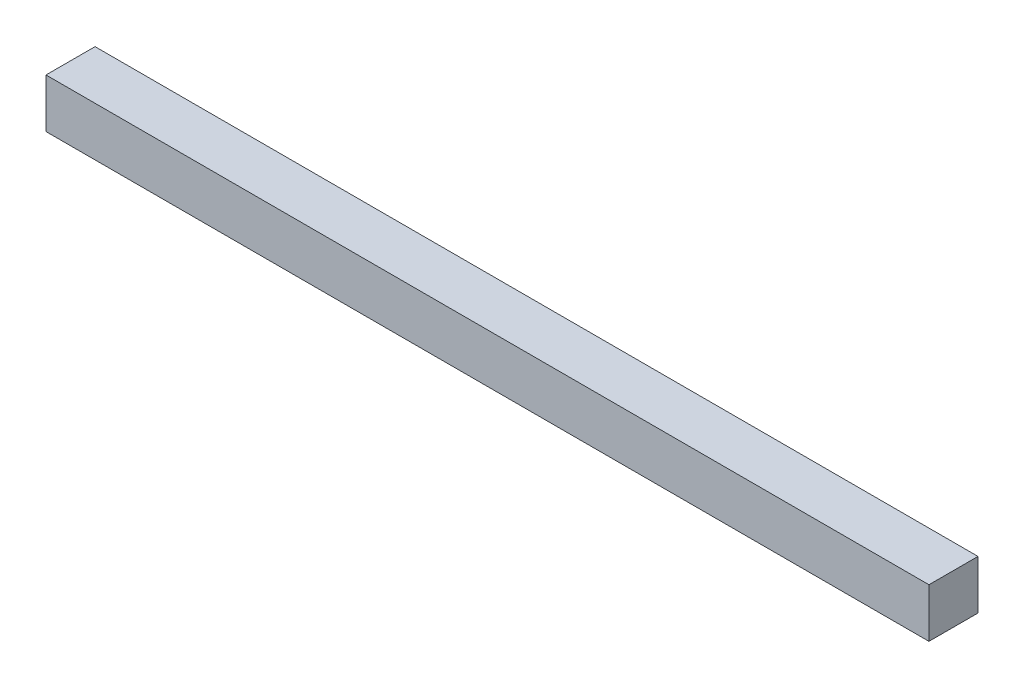
ISO-10303-21;
HEADER;
FILE_DESCRIPTION(('STEP AP214'),'2;1');
FILE_NAME('part.step','',(''),(''),'','','');
FILE_SCHEMA(('AUTOMOTIVE_DESIGN { 1 0 10303 214 1 1 1 1 }'));
ENDSEC;
DATA;
#1=APPLICATION_CONTEXT('core data for automotive mechanical design processes');
#2=APPLICATION_PROTOCOL_DEFINITION('international standard','automotive_design',2000,#1);
#3=PRODUCT_CONTEXT('',#1,'mechanical');
#4=PRODUCT('Part','Part','',(#3));
#5=PRODUCT_RELATED_PRODUCT_CATEGORY('part','',(#4));
#6=PRODUCT_DEFINITION_FORMATION('','',#4);
#7=PRODUCT_DEFINITION_CONTEXT('part definition',#1,'design');
#8=PRODUCT_DEFINITION('design','',#6,#7);
#9=PRODUCT_DEFINITION_SHAPE('','',#8);
#10=(LENGTH_UNIT() NAMED_UNIT(*) SI_UNIT(.MILLI.,.METRE.));
#11=(NAMED_UNIT(*) PLANE_ANGLE_UNIT() SI_UNIT($,.RADIAN.));
#12=(NAMED_UNIT(*) SI_UNIT($,.STERADIAN.) SOLID_ANGLE_UNIT());
#13=UNCERTAINTY_MEASURE_WITH_UNIT(LENGTH_MEASURE(1.E-05),#10,'distance_accuracy_value','');
#14=(GEOMETRIC_REPRESENTATION_CONTEXT(3) GLOBAL_UNCERTAINTY_ASSIGNED_CONTEXT((#13)) GLOBAL_UNIT_ASSIGNED_CONTEXT((#10,
#11,#12)) REPRESENTATION_CONTEXT('',''));
#15=CARTESIAN_POINT('',(0.,0.,0.));
#16=DIRECTION('',(0.,0.,1.));
#17=DIRECTION('',(1.,0.,0.));
#18=AXIS2_PLACEMENT_3D('',#15,#16,#17);
#19=CARTESIAN_POINT('',(457.2,0.,0.));
#20=DIRECTION('',(0.,0.,-1.));
#21=DIRECTION('',(-1.,0.,0.));
#22=AXIS2_PLACEMENT_3D('',#19,#20,#21);
#23=PLANE('',#22);
#24=DIRECTION('',(0.,-1.,0.));
#25=VECTOR('',#24,1.);
#26=CARTESIAN_POINT('',(0.,0.,0.));
#27=LINE('',#26,#25);
#28=CARTESIAN_POINT('',(0.,25.4,0.));
#29=VERTEX_POINT('',#28);
#30=CARTESIAN_POINT('',(0.,0.,0.));
#31=VERTEX_POINT('',#30);
#32=EDGE_CURVE('E115',#29,#31,#27,.T.);
#33=ORIENTED_EDGE('',*,*,#32,.T.);
#34=DIRECTION('',(-1.,0.,0.));
#35=VECTOR('',#34,1.);
#36=CARTESIAN_POINT('',(457.2,0.,0.));
#37=LINE('',#36,#35);
#38=CARTESIAN_POINT('',(457.2,0.,0.));
#39=VERTEX_POINT('',#38);
#40=EDGE_CURVE('E11',#39,#31,#37,.T.);
#41=ORIENTED_EDGE('',*,*,#40,.F.);
#42=DIRECTION('',(0.,-1.,0.));
#43=VECTOR('',#42,1.);
#44=CARTESIAN_POINT('',(457.2,0.,0.));
#45=LINE('',#44,#43);
#46=CARTESIAN_POINT('',(457.2,25.4,0.));
#47=VERTEX_POINT('',#46);
#48=EDGE_CURVE('E98',#47,#39,#45,.T.);
#49=ORIENTED_EDGE('',*,*,#48,.F.);
#50=DIRECTION('',(-1.,0.,0.));
#51=VECTOR('',#50,1.);
#52=CARTESIAN_POINT('',(457.2,25.4,0.));
#53=LINE('',#52,#51);
#54=EDGE_CURVE('E111',#47,#29,#53,.T.);
#55=ORIENTED_EDGE('',*,*,#54,.T.);
#56=EDGE_LOOP('',(#33,#41,#49,#55));
#57=FACE_BOUND('',#56,.T.);
#58=ADVANCED_FACE('F38',(#57),#23,.F.);
#59=CARTESIAN_POINT('',(457.2,0.,0.));
#60=DIRECTION('',(0.,1.,0.));
#61=DIRECTION('',(0.,0.,1.));
#62=AXIS2_PLACEMENT_3D('',#59,#60,#61);
#63=PLANE('',#62);
#64=DIRECTION('',(0.,0.,-1.));
#65=VECTOR('',#64,1.);
#66=CARTESIAN_POINT('',(0.,0.,0.));
#67=LINE('',#66,#65);
#68=CARTESIAN_POINT('',(0.,0.,-25.4));
#69=VERTEX_POINT('',#68);
#70=EDGE_CURVE('E103',#31,#69,#67,.T.);
#71=ORIENTED_EDGE('',*,*,#70,.T.);
#72=DIRECTION('',(-1.,0.,0.));
#73=VECTOR('',#72,1.);
#74=CARTESIAN_POINT('',(457.2,0.,-25.4));
#75=LINE('',#74,#73);
#76=CARTESIAN_POINT('',(457.2,0.,-25.4));
#77=VERTEX_POINT('',#76);
#78=EDGE_CURVE('E47',#77,#69,#75,.T.);
#79=ORIENTED_EDGE('',*,*,#78,.F.);
#80=DIRECTION('',(0.,0.,-1.));
#81=VECTOR('',#80,1.);
#82=CARTESIAN_POINT('',(457.2,0.,0.));
#83=LINE('',#82,#81);
#84=EDGE_CURVE('E93',#39,#77,#83,.T.);
#85=ORIENTED_EDGE('',*,*,#84,.F.);
#86=ORIENTED_EDGE('',*,*,#40,.T.);
#87=EDGE_LOOP('',(#71,#79,#85,#86));
#88=FACE_BOUND('',#87,.T.);
#89=ADVANCED_FACE('F102',(#88),#63,.F.);
#90=CARTESIAN_POINT('',(457.2,0.,-25.4));
#91=DIRECTION('',(0.,0.,1.));
#92=DIRECTION('',(0.,-1.,0.));
#93=AXIS2_PLACEMENT_3D('',#90,#91,#92);
#94=PLANE('',#93);
#95=DIRECTION('',(0.,1.,0.));
#96=VECTOR('',#95,1.);
#97=CARTESIAN_POINT('',(0.,0.,-25.4));
#98=LINE('',#97,#96);
#99=CARTESIAN_POINT('',(0.,25.4,-25.4));
#100=VERTEX_POINT('',#99);
#101=EDGE_CURVE('E78',#69,#100,#98,.T.);
#102=ORIENTED_EDGE('',*,*,#101,.T.);
#103=DIRECTION('',(-1.,0.,0.));
#104=VECTOR('',#103,1.);
#105=CARTESIAN_POINT('',(457.2,25.4,-25.4));
#106=LINE('',#105,#104);
#107=CARTESIAN_POINT('',(457.2,25.4,-25.4));
#108=VERTEX_POINT('',#107);
#109=EDGE_CURVE('E105',#108,#100,#106,.T.);
#110=ORIENTED_EDGE('',*,*,#109,.F.);
#111=DIRECTION('',(0.,1.,0.));
#112=VECTOR('',#111,1.);
#113=CARTESIAN_POINT('',(457.2,0.,-25.4));
#114=LINE('',#113,#112);
#115=EDGE_CURVE('E96',#77,#108,#114,.T.);
#116=ORIENTED_EDGE('',*,*,#115,.F.);
#117=ORIENTED_EDGE('',*,*,#78,.T.);
#118=EDGE_LOOP('',(#102,#110,#116,#117));
#119=FACE_BOUND('',#118,.T.);
#120=ADVANCED_FACE('F106',(#119),#94,.F.);
#121=CARTESIAN_POINT('',(457.2,25.4,0.));
#122=DIRECTION('',(0.,-1.,0.));
#123=DIRECTION('',(0.,0.,-1.));
#124=AXIS2_PLACEMENT_3D('',#121,#122,#123);
#125=PLANE('',#124);
#126=DIRECTION('',(0.,0.,1.));
#127=VECTOR('',#126,1.);
#128=CARTESIAN_POINT('',(0.,25.4,0.));
#129=LINE('',#128,#127);
#130=EDGE_CURVE('E85',#100,#29,#129,.T.);
#131=ORIENTED_EDGE('',*,*,#130,.T.);
#132=ORIENTED_EDGE('',*,*,#54,.F.);
#133=DIRECTION('',(0.,0.,1.));
#134=VECTOR('',#133,1.);
#135=CARTESIAN_POINT('',(457.2,25.4,0.));
#136=LINE('',#135,#134);
#137=EDGE_CURVE('E58',#108,#47,#136,.T.);
#138=ORIENTED_EDGE('',*,*,#137,.F.);
#139=ORIENTED_EDGE('',*,*,#109,.T.);
#140=EDGE_LOOP('',(#131,#132,#138,#139));
#141=FACE_BOUND('',#140,.T.);
#142=ADVANCED_FACE('F128',(#141),#125,.F.);
#143=CARTESIAN_POINT('',(457.2,0.,0.));
#144=DIRECTION('',(-1.,0.,0.));
#145=DIRECTION('',(0.,0.,1.));
#146=AXIS2_PLACEMENT_3D('',#143,#144,#145);
#147=PLANE('',#146);
#148=ORIENTED_EDGE('',*,*,#48,.T.);
#149=ORIENTED_EDGE('',*,*,#84,.T.);
#150=ORIENTED_EDGE('',*,*,#115,.T.);
#151=ORIENTED_EDGE('',*,*,#137,.T.);
#152=EDGE_LOOP('',(#148,#149,#150,#151));
#153=FACE_BOUND('',#152,.T.);
#154=ADVANCED_FACE('F94',(#153),#147,.F.);
#155=CARTESIAN_POINT('',(0.,0.,0.));
#156=DIRECTION('',(-1.,0.,0.));
#157=DIRECTION('',(0.,0.,1.));
#158=AXIS2_PLACEMENT_3D('',#155,#156,#157);
#159=PLANE('',#158);
#160=ORIENTED_EDGE('',*,*,#32,.F.);
#161=ORIENTED_EDGE('',*,*,#130,.F.);
#162=ORIENTED_EDGE('',*,*,#101,.F.);
#163=ORIENTED_EDGE('',*,*,#70,.F.);
#164=EDGE_LOOP('',(#160,#161,#162,#163));
#165=FACE_BOUND('',#164,.T.);
#166=ADVANCED_FACE('F131',(#165),#159,.T.);
#167=CLOSED_SHELL('',(#58,#89,#120,#142,#154,#166));
#168=MANIFOLD_SOLID_BREP('B2',#167);
#169=ADVANCED_BREP_SHAPE_REPRESENTATION('',(#18,#168),#14);
#170=SHAPE_DEFINITION_REPRESENTATION(#9,#169);
ENDSEC;
END-ISO-10303-21;
